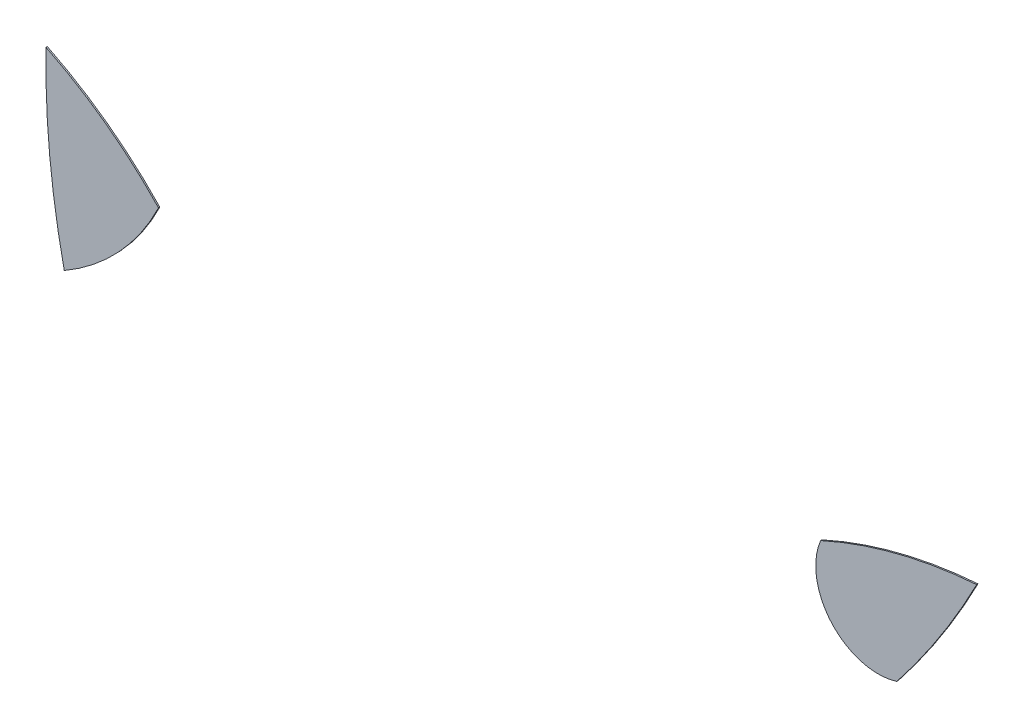
ISO-10303-21;
HEADER;
FILE_DESCRIPTION(('STEP AP214'),'2;1');
FILE_NAME('part.step','',(''),(''),'','','');
FILE_SCHEMA(('AUTOMOTIVE_DESIGN { 1 0 10303 214 1 1 1 1 }'));
ENDSEC;
DATA;
#1=APPLICATION_CONTEXT('core data for automotive mechanical design processes');
#2=APPLICATION_PROTOCOL_DEFINITION('international standard','automotive_design',2000,#1);
#3=PRODUCT_CONTEXT('',#1,'mechanical');
#4=PRODUCT('Part','Part','',(#3));
#5=PRODUCT_RELATED_PRODUCT_CATEGORY('part','',(#4));
#6=PRODUCT_DEFINITION_FORMATION('','',#4);
#7=PRODUCT_DEFINITION_CONTEXT('part definition',#1,'design');
#8=PRODUCT_DEFINITION('design','',#6,#7);
#9=PRODUCT_DEFINITION_SHAPE('','',#8);
#10=(LENGTH_UNIT() NAMED_UNIT(*) SI_UNIT(.MILLI.,.METRE.));
#11=(NAMED_UNIT(*) PLANE_ANGLE_UNIT() SI_UNIT($,.RADIAN.));
#12=(NAMED_UNIT(*) SI_UNIT($,.STERADIAN.) SOLID_ANGLE_UNIT());
#13=UNCERTAINTY_MEASURE_WITH_UNIT(LENGTH_MEASURE(1.E-05),#10,'distance_accuracy_value','');
#14=(GEOMETRIC_REPRESENTATION_CONTEXT(3) GLOBAL_UNCERTAINTY_ASSIGNED_CONTEXT((#13)) GLOBAL_UNIT_ASSIGNED_CONTEXT((#10,
#11,#12)) REPRESENTATION_CONTEXT('',''));
#15=CARTESIAN_POINT('',(0.,0.,0.));
#16=DIRECTION('',(0.,0.,1.));
#17=DIRECTION('',(1.,0.,0.));
#18=AXIS2_PLACEMENT_3D('',#15,#16,#17);
#19=CARTESIAN_POINT('',(-14.7084995595256,94.1605186560002,0.1));
#20=DIRECTION('',(0.,0.,-1.));
#21=DIRECTION('',(-1.,0.,0.));
#22=AXIS2_PLACEMENT_3D('',#19,#20,#21);
#23=CYLINDRICAL_SURFACE('',#22,17.7341478509682);
#24=CARTESIAN_POINT('',(-14.7084995595256,94.1605186560002,0.));
#25=DIRECTION('',(0.,0.,1.));
#26=DIRECTION('',(1.,0.,0.));
#27=AXIS2_PLACEMENT_3D('',#24,#25,#26);
#28=CIRCLE('',#27,17.7341478509682);
#29=CARTESIAN_POINT('',(-5.83351139402565,78.8068681108615,0.));
#30=VERTEX_POINT('',#29);
#31=CARTESIAN_POINT('',(1.25248696232,86.4309061657479,0.));
#32=VERTEX_POINT('',#31);
#33=EDGE_CURVE('E90',#30,#32,#28,.T.);
#34=ORIENTED_EDGE('',*,*,#33,.T.);
#35=DIRECTION('',(0.,0.,-1.));
#36=VECTOR('',#35,1.);
#37=CARTESIAN_POINT('',(1.25248696232,86.4309061657479,0.1));
#38=LINE('',#37,#36);
#39=CARTESIAN_POINT('',(1.25248696232,86.4309061657479,0.1));
#40=VERTEX_POINT('',#39);
#41=EDGE_CURVE('E12',#40,#32,#38,.T.);
#42=ORIENTED_EDGE('',*,*,#41,.F.);
#43=CARTESIAN_POINT('',(-14.7084995595256,94.1605186560002,0.1));
#44=DIRECTION('',(0.,0.,1.));
#45=DIRECTION('',(1.,0.,0.));
#46=AXIS2_PLACEMENT_3D('',#43,#44,#45);
#47=CIRCLE('',#46,17.7341478509682);
#48=CARTESIAN_POINT('',(-5.83351139402565,78.8068681108615,0.1));
#49=VERTEX_POINT('',#48);
#50=EDGE_CURVE('E83',#49,#40,#47,.T.);
#51=ORIENTED_EDGE('',*,*,#50,.F.);
#52=DIRECTION('',(0.,0.,-1.));
#53=VECTOR('',#52,1.);
#54=CARTESIAN_POINT('',(-5.83351139402565,78.8068681108615,0.1));
#55=LINE('',#54,#53);
#56=EDGE_CURVE('E91',#49,#30,#55,.T.);
#57=ORIENTED_EDGE('',*,*,#56,.T.);
#58=EDGE_LOOP('',(#34,#42,#51,#57));
#59=FACE_BOUND('',#58,.T.);
#60=ADVANCED_FACE('F43',(#59),#23,.T.);
#61=CARTESIAN_POINT('',(-20.3575551294456,65.9410132993905,0.1));
#62=DIRECTION('',(0.,0.,-1.));
#63=DIRECTION('',(-1.,0.,0.));
#64=AXIS2_PLACEMENT_3D('',#61,#62,#63);
#65=CYLINDRICAL_SURFACE('',#64,29.7796848351806);
#66=CARTESIAN_POINT('',(-20.3575551294456,65.9410132993905,0.));
#67=DIRECTION('',(0.,0.,1.));
#68=DIRECTION('',(1.,0.,0.));
#69=AXIS2_PLACEMENT_3D('',#66,#67,#68);
#70=CIRCLE('',#69,29.7796848351806);
#71=CARTESIAN_POINT('',(-7.20849955952562,92.6605186559992,0.));
#72=VERTEX_POINT('',#71);
#73=EDGE_CURVE('E71',#32,#72,#70,.T.);
#74=ORIENTED_EDGE('',*,*,#73,.T.);
#75=DIRECTION('',(0.,0.,-1.));
#76=VECTOR('',#75,1.);
#77=CARTESIAN_POINT('',(-7.20849955952562,92.6605186559992,0.1));
#78=LINE('',#77,#76);
#79=CARTESIAN_POINT('',(-7.20849955952562,92.6605186559992,0.1));
#80=VERTEX_POINT('',#79);
#81=EDGE_CURVE('E51',#80,#72,#78,.T.);
#82=ORIENTED_EDGE('',*,*,#81,.F.);
#83=CARTESIAN_POINT('',(-20.3575551294456,65.9410132993905,0.1));
#84=DIRECTION('',(0.,0.,1.));
#85=DIRECTION('',(1.,0.,0.));
#86=AXIS2_PLACEMENT_3D('',#83,#84,#85);
#87=CIRCLE('',#86,29.7796848351806);
#88=EDGE_CURVE('E79',#40,#80,#87,.T.);
#89=ORIENTED_EDGE('',*,*,#88,.F.);
#90=ORIENTED_EDGE('',*,*,#41,.T.);
#91=EDGE_LOOP('',(#74,#82,#89,#90));
#92=FACE_BOUND('',#91,.T.);
#93=ADVANCED_FACE('F80',(#92),#65,.T.);
#94=CARTESIAN_POINT('',(52.394395142261,91.5811036636974,0.1));
#95=DIRECTION('',(0.,0.,-1.));
#96=DIRECTION('',(-1.,0.,0.));
#97=AXIS2_PLACEMENT_3D('',#94,#95,#96);
#98=CYLINDRICAL_SURFACE('',#97,59.6126680627353);
#99=CARTESIAN_POINT('',(52.394395142261,91.5811036636974,0.));
#100=DIRECTION('',(0.,0.,1.));
#101=DIRECTION('',(1.,0.,0.));
#102=AXIS2_PLACEMENT_3D('',#99,#100,#101);
#103=CIRCLE('',#102,59.6126680627353);
#104=EDGE_CURVE('E76',#72,#30,#103,.T.);
#105=ORIENTED_EDGE('',*,*,#104,.T.);
#106=ORIENTED_EDGE('',*,*,#56,.F.);
#107=CARTESIAN_POINT('',(52.394395142261,91.5811036636974,0.1));
#108=DIRECTION('',(0.,0.,1.));
#109=DIRECTION('',(1.,0.,0.));
#110=AXIS2_PLACEMENT_3D('',#107,#108,#109);
#111=CIRCLE('',#110,59.6126680627353);
#112=EDGE_CURVE('E59',#80,#49,#111,.T.);
#113=ORIENTED_EDGE('',*,*,#112,.F.);
#114=ORIENTED_EDGE('',*,*,#81,.T.);
#115=EDGE_LOOP('',(#105,#106,#113,#114));
#116=FACE_BOUND('',#115,.T.);
#117=ADVANCED_FACE('F98',(#116),#98,.T.);
#118=CARTESIAN_POINT('',(-17.5330273444856,80.0507659776953,0.1));
#119=DIRECTION('',(0.,0.,1.));
#120=DIRECTION('',(1.,0.,0.));
#121=AXIS2_PLACEMENT_3D('',#118,#119,#120);
#122=PLANE('',#121);
#123=ORIENTED_EDGE('',*,*,#50,.T.);
#124=ORIENTED_EDGE('',*,*,#88,.T.);
#125=ORIENTED_EDGE('',*,*,#112,.T.);
#126=EDGE_LOOP('',(#123,#124,#125));
#127=FACE_BOUND('',#126,.T.);
#128=ADVANCED_FACE('F86',(#127),#122,.T.);
#129=CARTESIAN_POINT('',(-17.5330273444856,80.0507659776953,0.));
#130=DIRECTION('',(0.,0.,1.));
#131=DIRECTION('',(1.,0.,0.));
#132=AXIS2_PLACEMENT_3D('',#129,#130,#131);
#133=PLANE('',#132);
#134=ORIENTED_EDGE('',*,*,#33,.F.);
#135=ORIENTED_EDGE('',*,*,#104,.F.);
#136=ORIENTED_EDGE('',*,*,#73,.F.);
#137=EDGE_LOOP('',(#134,#135,#136));
#138=FACE_BOUND('',#137,.T.);
#139=ADVANCED_FACE('F99',(#138),#133,.F.);
#140=CLOSED_SHELL('',(#60,#93,#117,#128,#139));
#141=MANIFOLD_SOLID_BREP('B2',#140);
#142=CARTESIAN_POINT('',(55.3871977717085,87.8350981296895,0.1));
#143=DIRECTION('',(0.,0.,-1.));
#144=DIRECTION('',(-1.,0.,0.));
#145=AXIS2_PLACEMENT_3D('',#142,#143,#144);
#146=CYLINDRICAL_SURFACE('',#145,4.70075778883933);
#147=CARTESIAN_POINT('',(55.3871977717085,87.8350981296895,0.));
#148=DIRECTION('',(0.,0.,1.));
#149=DIRECTION('',(1.,0.,0.));
#150=AXIS2_PLACEMENT_3D('',#147,#148,#149);
#151=CIRCLE('',#150,4.70075778883933);
#152=CARTESIAN_POINT('',(51.0557954669173,89.6615914538994,0.));
#153=VERTEX_POINT('',#152);
#154=CARTESIAN_POINT('',(56.7853138998789,83.3470701572406,0.));
#155=VERTEX_POINT('',#154);
#156=EDGE_CURVE('E188',#153,#155,#151,.T.);
#157=ORIENTED_EDGE('',*,*,#156,.T.);
#158=DIRECTION('',(0.,0.,-1.));
#159=VECTOR('',#158,1.);
#160=CARTESIAN_POINT('',(56.7853138998789,83.3470701572406,0.1));
#161=LINE('',#160,#159);
#162=CARTESIAN_POINT('',(56.7853138998789,83.3470701572406,0.1));
#163=VERTEX_POINT('',#162);
#164=EDGE_CURVE('E41',#163,#155,#161,.T.);
#165=ORIENTED_EDGE('',*,*,#164,.F.);
#166=CARTESIAN_POINT('',(55.3871977717085,87.8350981296895,0.1));
#167=DIRECTION('',(0.,0.,1.));
#168=DIRECTION('',(1.,0.,0.));
#169=AXIS2_PLACEMENT_3D('',#166,#167,#168);
#170=CIRCLE('',#169,4.70075778883933);
#171=CARTESIAN_POINT('',(51.0557954669173,89.6615914538994,0.1));
#172=VERTEX_POINT('',#171);
#173=EDGE_CURVE('E181',#172,#163,#170,.T.);
#174=ORIENTED_EDGE('',*,*,#173,.F.);
#175=DIRECTION('',(0.,0.,-1.));
#176=VECTOR('',#175,1.);
#177=CARTESIAN_POINT('',(51.0557954669173,89.6615914538994,0.1));
#178=LINE('',#177,#176);
#179=EDGE_CURVE('E189',#172,#153,#178,.T.);
#180=ORIENTED_EDGE('',*,*,#179,.T.);
#181=EDGE_LOOP('',(#157,#165,#174,#180));
#182=FACE_BOUND('',#181,.T.);
#183=ADVANCED_FACE('F141',(#182),#146,.T.);
#184=CARTESIAN_POINT('',(10.9716661599254,119.485415081343,0.1));
#185=DIRECTION('',(0.,0.,-1.));
#186=DIRECTION('',(-1.,0.,0.));
#187=AXIS2_PLACEMENT_3D('',#184,#185,#186);
#188=CYLINDRICAL_SURFACE('',#187,58.3512664223659);
#189=CARTESIAN_POINT('',(10.9716661599254,119.485415081343,0.));
#190=DIRECTION('',(0.,0.,1.));
#191=DIRECTION('',(1.,0.,0.));
#192=AXIS2_PLACEMENT_3D('',#189,#190,#191);
#193=CIRCLE('',#192,58.3512664223659);
#194=CARTESIAN_POINT('',(62.7915004404743,92.6605186559999,0.));
#195=VERTEX_POINT('',#194);
#196=EDGE_CURVE('E169',#155,#195,#193,.T.);
#197=ORIENTED_EDGE('',*,*,#196,.T.);
#198=DIRECTION('',(0.,0.,-1.));
#199=VECTOR('',#198,1.);
#200=CARTESIAN_POINT('',(62.7915004404743,92.6605186559999,0.1));
#201=LINE('',#200,#199);
#202=CARTESIAN_POINT('',(62.7915004404743,92.6605186559999,0.1));
#203=VERTEX_POINT('',#202);
#204=EDGE_CURVE('E149',#203,#195,#201,.T.);
#205=ORIENTED_EDGE('',*,*,#204,.F.);
#206=CARTESIAN_POINT('',(10.9716661599254,119.485415081343,0.1));
#207=DIRECTION('',(0.,0.,1.));
#208=DIRECTION('',(1.,0.,0.));
#209=AXIS2_PLACEMENT_3D('',#206,#207,#208);
#210=CIRCLE('',#209,58.3512664223659);
#211=EDGE_CURVE('E177',#163,#203,#210,.T.);
#212=ORIENTED_EDGE('',*,*,#211,.F.);
#213=ORIENTED_EDGE('',*,*,#164,.T.);
#214=EDGE_LOOP('',(#197,#205,#212,#213));
#215=FACE_BOUND('',#214,.T.);
#216=ADVANCED_FACE('F178',(#215),#188,.T.);
#217=CARTESIAN_POINT('',(65.3463902861478,58.2003286282753,0.1));
#218=DIRECTION('',(0.,0.,-1.));
#219=DIRECTION('',(-1.,0.,0.));
#220=AXIS2_PLACEMENT_3D('',#217,#218,#219);
#221=CYLINDRICAL_SURFACE('',#220,34.5547704213241);
#222=CARTESIAN_POINT('',(65.3463902861478,58.2003286282753,0.));
#223=DIRECTION('',(0.,0.,1.));
#224=DIRECTION('',(1.,0.,0.));
#225=AXIS2_PLACEMENT_3D('',#222,#223,#224);
#226=CIRCLE('',#225,34.5547704213241);
#227=EDGE_CURVE('E174',#195,#153,#226,.T.);
#228=ORIENTED_EDGE('',*,*,#227,.T.);
#229=ORIENTED_EDGE('',*,*,#179,.F.);
#230=CARTESIAN_POINT('',(65.3463902861478,58.2003286282753,0.1));
#231=DIRECTION('',(0.,0.,1.));
#232=DIRECTION('',(1.,0.,0.));
#233=AXIS2_PLACEMENT_3D('',#230,#231,#232);
#234=CIRCLE('',#233,34.5547704213241);
#235=EDGE_CURVE('E157',#203,#172,#234,.T.);
#236=ORIENTED_EDGE('',*,*,#235,.F.);
#237=ORIENTED_EDGE('',*,*,#204,.T.);
#238=EDGE_LOOP('',(#228,#229,#236,#237));
#239=FACE_BOUND('',#238,.T.);
#240=ADVANCED_FACE('F196',(#239),#221,.T.);
#241=CARTESIAN_POINT('',(33.179431965817,103.660256605516,0.1));
#242=DIRECTION('',(0.,0.,1.));
#243=DIRECTION('',(1.,0.,0.));
#244=AXIS2_PLACEMENT_3D('',#241,#242,#243);
#245=PLANE('',#244);
#246=ORIENTED_EDGE('',*,*,#173,.T.);
#247=ORIENTED_EDGE('',*,*,#211,.T.);
#248=ORIENTED_EDGE('',*,*,#235,.T.);
#249=EDGE_LOOP('',(#246,#247,#248));
#250=FACE_BOUND('',#249,.T.);
#251=ADVANCED_FACE('F184',(#250),#245,.T.);
#252=CARTESIAN_POINT('',(33.179431965817,103.660256605516,0.));
#253=DIRECTION('',(0.,0.,1.));
#254=DIRECTION('',(1.,0.,0.));
#255=AXIS2_PLACEMENT_3D('',#252,#253,#254);
#256=PLANE('',#255);
#257=ORIENTED_EDGE('',*,*,#156,.F.);
#258=ORIENTED_EDGE('',*,*,#227,.F.);
#259=ORIENTED_EDGE('',*,*,#196,.F.);
#260=EDGE_LOOP('',(#257,#258,#259));
#261=FACE_BOUND('',#260,.T.);
#262=ADVANCED_FACE('F197',(#261),#256,.F.);
#263=CLOSED_SHELL('',(#183,#216,#240,#251,#262));
#264=MANIFOLD_SOLID_BREP('B6',#263);
#265=ADVANCED_BREP_SHAPE_REPRESENTATION('',(#18,#141,#264),#14);
#266=SHAPE_DEFINITION_REPRESENTATION(#9,#265);
ENDSEC;
END-ISO-10303-21;
